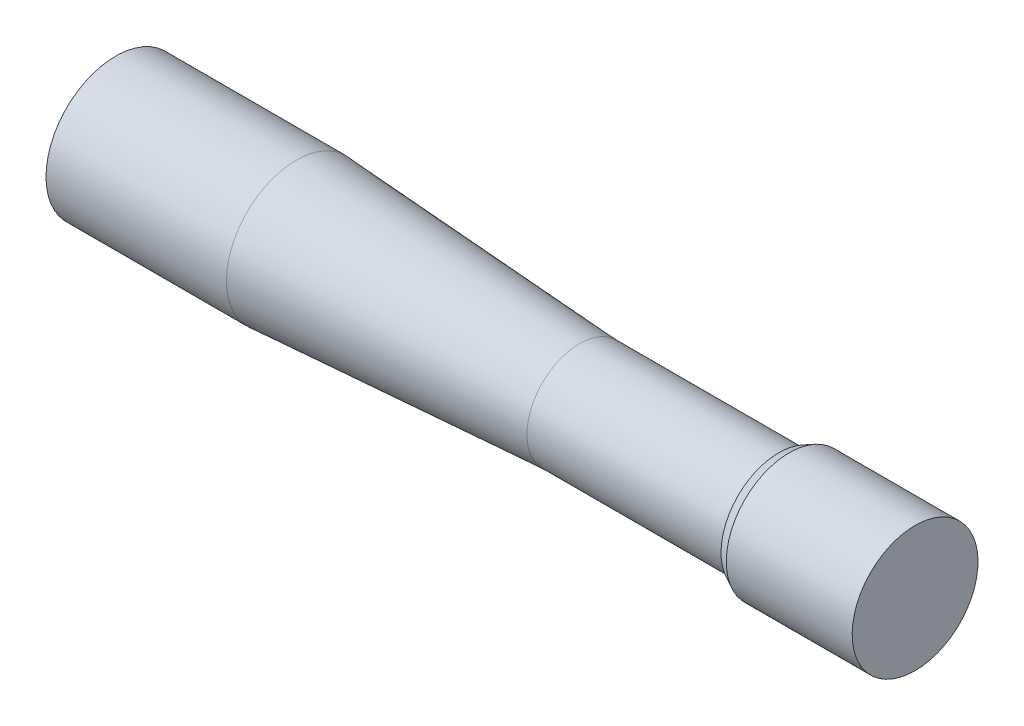
ISO-10303-21;
HEADER;
FILE_DESCRIPTION(('STEP AP214'),'2;1');
FILE_NAME('part.step','',(''),(''),'','','');
FILE_SCHEMA(('AUTOMOTIVE_DESIGN { 1 0 10303 214 1 1 1 1 }'));
ENDSEC;
DATA;
#1=APPLICATION_CONTEXT('core data for automotive mechanical design processes');
#2=APPLICATION_PROTOCOL_DEFINITION('international standard','automotive_design',2000,#1);
#3=PRODUCT_CONTEXT('',#1,'mechanical');
#4=PRODUCT('Part','Part','',(#3));
#5=PRODUCT_RELATED_PRODUCT_CATEGORY('part','',(#4));
#6=PRODUCT_DEFINITION_FORMATION('','',#4);
#7=PRODUCT_DEFINITION_CONTEXT('part definition',#1,'design');
#8=PRODUCT_DEFINITION('design','',#6,#7);
#9=PRODUCT_DEFINITION_SHAPE('','',#8);
#10=(LENGTH_UNIT() NAMED_UNIT(*) SI_UNIT(.MILLI.,.METRE.));
#11=(NAMED_UNIT(*) PLANE_ANGLE_UNIT() SI_UNIT($,.RADIAN.));
#12=(NAMED_UNIT(*) SI_UNIT($,.STERADIAN.) SOLID_ANGLE_UNIT());
#13=UNCERTAINTY_MEASURE_WITH_UNIT(LENGTH_MEASURE(1.E-05),#10,'distance_accuracy_value','');
#14=(GEOMETRIC_REPRESENTATION_CONTEXT(3) GLOBAL_UNCERTAINTY_ASSIGNED_CONTEXT((#13)) GLOBAL_UNIT_ASSIGNED_CONTEXT((#10,
#11,#12)) REPRESENTATION_CONTEXT('',''));
#15=CARTESIAN_POINT('',(0.,0.,0.));
#16=DIRECTION('',(0.,0.,1.));
#17=DIRECTION('',(1.,0.,0.));
#18=AXIS2_PLACEMENT_3D('',#15,#16,#17);
#19=CARTESIAN_POINT('',(76.2,0.,0.));
#20=DIRECTION('',(1.,0.,0.));
#21=DIRECTION('',(0.,1.,0.));
#22=AXIS2_PLACEMENT_3D('',#19,#20,#21);
#23=PLANE('',#22);
#24=CARTESIAN_POINT('',(76.2,0.,0.));
#25=DIRECTION('',(1.,0.,0.));
#26=DIRECTION('',(0.,0.,-1.));
#27=AXIS2_PLACEMENT_3D('',#24,#25,#26);
#28=CIRCLE('',#27,6.);
#29=CARTESIAN_POINT('',(76.2,-6.,0.));
#30=VERTEX_POINT('',#29);
#31=EDGE_CURVE('E41',#30,#30,#28,.T.);
#32=ORIENTED_EDGE('',*,*,#31,.T.);
#33=EDGE_LOOP('',(#32));
#34=FACE_BOUND('',#33,.T.);
#35=ADVANCED_FACE('F32',(#34),#23,.T.);
#36=CARTESIAN_POINT('',(70.2,0.,0.));
#37=DIRECTION('',(1.,0.,0.));
#38=DIRECTION('',(0.,1.,0.));
#39=AXIS2_PLACEMENT_3D('',#36,#37,#38);
#40=CYLINDRICAL_SURFACE('',#39,6.);
#41=ORIENTED_EDGE('',*,*,#31,.F.);
#42=DIRECTION('',(-1.,0.,0.));
#43=VECTOR('',#42,1.);
#44=CARTESIAN_POINT('',(70.2,-6.,0.));
#45=LINE('',#44,#43);
#46=CARTESIAN_POINT('',(64.2,-6.,0.));
#47=VERTEX_POINT('',#46);
#48=EDGE_CURVE('E11',#30,#47,#45,.T.);
#49=ORIENTED_EDGE('',*,*,#48,.T.);
#50=CARTESIAN_POINT('',(64.2,0.,0.));
#51=DIRECTION('',(1.,0.,0.));
#52=DIRECTION('',(0.,0.,-1.));
#53=AXIS2_PLACEMENT_3D('',#50,#51,#52);
#54=CIRCLE('',#53,6.);
#55=EDGE_CURVE('E72',#47,#47,#54,.T.);
#56=ORIENTED_EDGE('',*,*,#55,.T.);
#57=ORIENTED_EDGE('',*,*,#48,.F.);
#58=EDGE_LOOP('',(#41,#49,#56,#57));
#59=FACE_BOUND('',#58,.T.);
#60=ADVANCED_FACE('F81',(#59),#40,.T.);
#61=CARTESIAN_POINT('',(63.7,0.,0.));
#62=DIRECTION('',(1.,0.,0.));
#63=DIRECTION('',(0.,1.,0.));
#64=AXIS2_PLACEMENT_3D('',#61,#62,#63);
#65=CONICAL_SURFACE('',#64,5.75,0.463647609000807);
#66=ORIENTED_EDGE('',*,*,#55,.F.);
#67=DIRECTION('',(-0.894427190999915,0.447213595499959,0.));
#68=VECTOR('',#67,1.);
#69=CARTESIAN_POINT('',(63.7,-5.75,0.));
#70=LINE('',#69,#68);
#71=CARTESIAN_POINT('',(63.2,-5.5,0.));
#72=VERTEX_POINT('',#71);
#73=EDGE_CURVE('E76',#47,#72,#70,.T.);
#74=ORIENTED_EDGE('',*,*,#73,.T.);
#75=CARTESIAN_POINT('',(63.2,0.,0.));
#76=DIRECTION('',(1.,0.,0.));
#77=DIRECTION('',(0.,0.,-1.));
#78=AXIS2_PLACEMENT_3D('',#75,#76,#77);
#79=CIRCLE('',#78,5.5);
#80=EDGE_CURVE('E35',#72,#72,#79,.T.);
#81=ORIENTED_EDGE('',*,*,#80,.T.);
#82=ORIENTED_EDGE('',*,*,#73,.F.);
#83=EDGE_LOOP('',(#66,#74,#81,#82));
#84=FACE_BOUND('',#83,.T.);
#85=ADVANCED_FACE('F82',(#84),#65,.T.);
#86=CARTESIAN_POINT('',(63.2,5.5,0.));
#87=DIRECTION('',(-1.,0.,0.));
#88=DIRECTION('',(0.,0.,1.));
#89=AXIS2_PLACEMENT_3D('',#86,#87,#88);
#90=PLANE('',#89);
#91=CARTESIAN_POINT('',(63.2,0.,0.));
#92=DIRECTION('',(1.,0.,0.));
#93=DIRECTION('',(0.,0.,-1.));
#94=AXIS2_PLACEMENT_3D('',#91,#92,#93);
#95=CIRCLE('',#94,5.);
#96=CARTESIAN_POINT('',(63.2,-5.,0.));
#97=VERTEX_POINT('',#96);
#98=EDGE_CURVE('E66',#97,#97,#95,.T.);
#99=ORIENTED_EDGE('',*,*,#98,.T.);
#100=EDGE_LOOP('',(#99));
#101=FACE_BOUND('',#100,.T.);
#102=ORIENTED_EDGE('',*,*,#80,.F.);
#103=EDGE_LOOP('',(#102));
#104=FACE_BOUND('',#103,.T.);
#105=ADVANCED_FACE('F85',(#101,#104),#90,.T.);
#106=CARTESIAN_POINT('',(53.7,0.,0.));
#107=DIRECTION('',(1.,0.,0.));
#108=DIRECTION('',(0.,1.,0.));
#109=AXIS2_PLACEMENT_3D('',#106,#107,#108);
#110=CYLINDRICAL_SURFACE('',#109,5.);
#111=ORIENTED_EDGE('',*,*,#98,.F.);
#112=DIRECTION('',(-1.,0.,0.));
#113=VECTOR('',#112,1.);
#114=CARTESIAN_POINT('',(53.7,-5.,0.));
#115=LINE('',#114,#113);
#116=CARTESIAN_POINT('',(44.2,-5.,0.));
#117=VERTEX_POINT('',#116);
#118=EDGE_CURVE('E60',#97,#117,#115,.T.);
#119=ORIENTED_EDGE('',*,*,#118,.T.);
#120=CARTESIAN_POINT('',(44.2,0.,0.));
#121=DIRECTION('',(-1.,0.,0.));
#122=DIRECTION('',(0.,0.,1.));
#123=AXIS2_PLACEMENT_3D('',#120,#121,#122);
#124=CIRCLE('',#123,5.);
#125=EDGE_CURVE('E64',#117,#117,#124,.T.);
#126=ORIENTED_EDGE('',*,*,#125,.F.);
#127=ORIENTED_EDGE('',*,*,#118,.F.);
#128=EDGE_LOOP('',(#111,#119,#126,#127));
#129=FACE_BOUND('',#128,.T.);
#130=ADVANCED_FACE('F69',(#129),#110,.T.);
#131=CARTESIAN_POINT('',(44.2,0.,0.));
#132=DIRECTION('',(-1.,0.,0.));
#133=DIRECTION('',(0.,0.,1.));
#134=AXIS2_PLACEMENT_3D('',#131,#132,#133);
#135=CONICAL_SURFACE('',#134,5.,0.0610352065896861);
#136=CARTESIAN_POINT('',(17.1999999999987,0.,0.));
#137=DIRECTION('',(-1.,0.,0.));
#138=DIRECTION('',(0.,0.,1.));
#139=AXIS2_PLACEMENT_3D('',#136,#137,#138);
#140=CIRCLE('',#139,6.65);
#141=CARTESIAN_POINT('',(17.1999999999987,0.,6.65));
#142=VERTEX_POINT('',#141);
#143=EDGE_CURVE('E67',#142,#142,#140,.T.);
#144=ORIENTED_EDGE('',*,*,#143,.F.);
#145=EDGE_LOOP('',(#144));
#146=FACE_BOUND('',#145,.T.);
#147=ORIENTED_EDGE('',*,*,#125,.T.);
#148=EDGE_LOOP('',(#147));
#149=FACE_BOUND('',#148,.T.);
#150=ADVANCED_FACE('F65',(#146,#149),#135,.T.);
#151=CARTESIAN_POINT('',(-2.21972059975779,0.,0.));
#152=DIRECTION('',(-1.,0.,0.));
#153=DIRECTION('',(0.,0.,1.));
#154=AXIS2_PLACEMENT_3D('',#151,#152,#153);
#155=CYLINDRICAL_SURFACE('',#154,6.65);
#156=CARTESIAN_POINT('',(0.,0.,0.));
#157=DIRECTION('',(-1.,0.,0.));
#158=DIRECTION('',(0.,0.,1.));
#159=AXIS2_PLACEMENT_3D('',#156,#157,#158);
#160=CIRCLE('',#159,6.65);
#161=CARTESIAN_POINT('',(0.,0.,6.65));
#162=VERTEX_POINT('',#161);
#163=EDGE_CURVE('E117',#162,#162,#160,.T.);
#164=ORIENTED_EDGE('',*,*,#163,.F.);
#165=EDGE_LOOP('',(#164));
#166=FACE_BOUND('',#165,.T.);
#167=ORIENTED_EDGE('',*,*,#143,.T.);
#168=EDGE_LOOP('',(#167));
#169=FACE_BOUND('',#168,.T.);
#170=ADVANCED_FACE('F105',(#166,#169),#155,.T.);
#171=CARTESIAN_POINT('',(0.,6.4,0.));
#172=DIRECTION('',(-1.,0.,0.));
#173=DIRECTION('',(0.,0.,1.));
#174=AXIS2_PLACEMENT_3D('',#171,#172,#173);
#175=PLANE('',#174);
#176=ORIENTED_EDGE('',*,*,#163,.T.);
#177=EDGE_LOOP('',(#176));
#178=FACE_BOUND('',#177,.T.);
#179=ADVANCED_FACE('F108',(#178),#175,.T.);
#180=CLOSED_SHELL('',(#35,#60,#85,#105,#130,#150,#170,#179));
#181=MANIFOLD_SOLID_BREP('B2',#180);
#182=ADVANCED_BREP_SHAPE_REPRESENTATION('',(#18,#181),#14);
#183=SHAPE_DEFINITION_REPRESENTATION(#9,#182);
ENDSEC;
END-ISO-10303-21;
